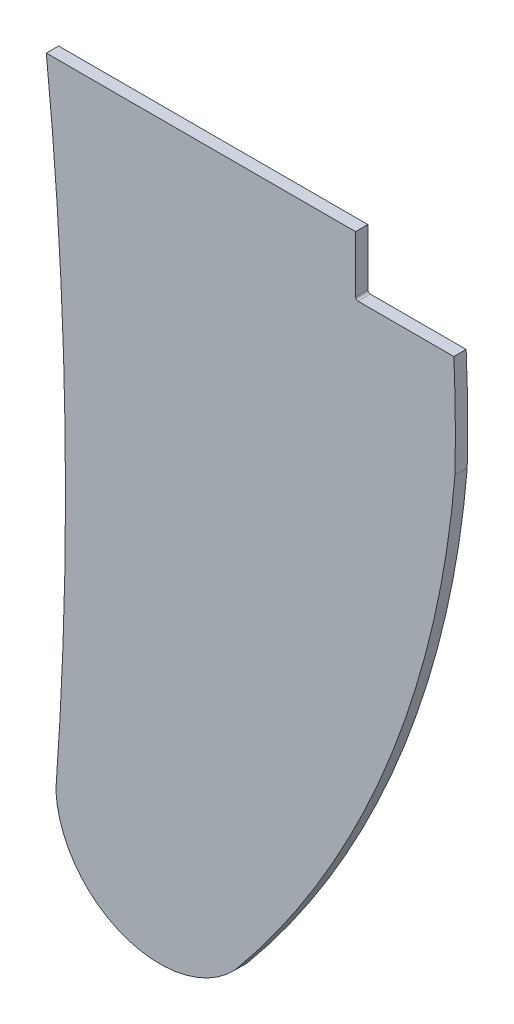
ISO-10303-21;
HEADER;
FILE_DESCRIPTION(('STEP AP214'),'2;1');
FILE_NAME('part.step','',(''),(''),'','','');
FILE_SCHEMA(('AUTOMOTIVE_DESIGN { 1 0 10303 214 1 1 1 1 }'));
ENDSEC;
DATA;
#1=APPLICATION_CONTEXT('core data for automotive mechanical design processes');
#2=APPLICATION_PROTOCOL_DEFINITION('international standard','automotive_design',2000,#1);
#3=PRODUCT_CONTEXT('',#1,'mechanical');
#4=PRODUCT('Part','Part','',(#3));
#5=PRODUCT_RELATED_PRODUCT_CATEGORY('part','',(#4));
#6=PRODUCT_DEFINITION_FORMATION('','',#4);
#7=PRODUCT_DEFINITION_CONTEXT('part definition',#1,'design');
#8=PRODUCT_DEFINITION('design','',#6,#7);
#9=PRODUCT_DEFINITION_SHAPE('','',#8);
#10=(LENGTH_UNIT() NAMED_UNIT(*) SI_UNIT(.MILLI.,.METRE.));
#11=(NAMED_UNIT(*) PLANE_ANGLE_UNIT() SI_UNIT($,.RADIAN.));
#12=(NAMED_UNIT(*) SI_UNIT($,.STERADIAN.) SOLID_ANGLE_UNIT());
#13=UNCERTAINTY_MEASURE_WITH_UNIT(LENGTH_MEASURE(1.E-05),#10,'distance_accuracy_value','');
#14=(GEOMETRIC_REPRESENTATION_CONTEXT(3) GLOBAL_UNCERTAINTY_ASSIGNED_CONTEXT((#13)) GLOBAL_UNIT_ASSIGNED_CONTEXT((#10,
#11,#12)) REPRESENTATION_CONTEXT('',''));
#15=CARTESIAN_POINT('',(0.,0.,0.));
#16=DIRECTION('',(0.,0.,1.));
#17=DIRECTION('',(1.,0.,0.));
#18=AXIS2_PLACEMENT_3D('',#15,#16,#17);
#19=CARTESIAN_POINT('',(-409.295189863832,-50.7608699241797,5.));
#20=DIRECTION('',(0.,0.,-1.));
#21=DIRECTION('',(-1.,0.,0.));
#22=AXIS2_PLACEMENT_3D('',#19,#20,#21);
#23=CYLINDRICAL_SURFACE('',#22,577.915115219369);
#24=DIRECTION('',(0.,0.,1.));
#25=VECTOR('',#24,1.);
#26=CARTESIAN_POINT('',(168.430239052864,-65.566584430278,0.));
#27=LINE('',#26,#25);
#28=CARTESIAN_POINT('',(168.430239052864,-65.566584430278,0.));
#29=VERTEX_POINT('',#28);
#30=CARTESIAN_POINT('',(168.430239052864,-65.566584430278,5.000006));
#31=VERTEX_POINT('',#30);
#32=EDGE_CURVE('E88',#29,#31,#27,.T.);
#33=ORIENTED_EDGE('',*,*,#32,.F.);
#34=CARTESIAN_POINT('',(-409.295189863832,-50.7608699241797,0.));
#35=DIRECTION('',(0.,0.,1.));
#36=DIRECTION('',(-1.,0.,0.));
#37=AXIS2_PLACEMENT_3D('',#34,#35,#36);
#38=CIRCLE('',#37,577.915115219369);
#39=CARTESIAN_POINT('',(168.,-24.,0.));
#40=VERTEX_POINT('',#39);
#41=EDGE_CURVE('E138',#29,#40,#38,.T.);
#42=ORIENTED_EDGE('',*,*,#41,.T.);
#43=DIRECTION('',(0.,0.,-1.));
#44=VECTOR('',#43,1.);
#45=CARTESIAN_POINT('',(168.,-24.,5.));
#46=LINE('',#45,#44);
#47=CARTESIAN_POINT('',(168.,-24.,5.));
#48=VERTEX_POINT('',#47);
#49=EDGE_CURVE('E111',#48,#40,#46,.T.);
#50=ORIENTED_EDGE('',*,*,#49,.F.);
#51=CARTESIAN_POINT('',(-409.295189863832,-50.7608699241797,5.));
#52=DIRECTION('',(0.,0.,1.));
#53=DIRECTION('',(-1.,0.,0.));
#54=AXIS2_PLACEMENT_3D('',#51,#52,#53);
#55=CIRCLE('',#54,577.915115219369);
#56=EDGE_CURVE('E105',#31,#48,#55,.T.);
#57=ORIENTED_EDGE('',*,*,#56,.F.);
#58=EDGE_LOOP('',(#33,#42,#50,#57));
#59=FACE_BOUND('',#58,.T.);
#60=ADVANCED_FACE('F20',(#59),#23,.T.);
#61=CARTESIAN_POINT('',(0.,0.,5.));
#62=DIRECTION('',(0.,-1.,0.));
#63=DIRECTION('',(0.,0.,-1.));
#64=AXIS2_PLACEMENT_3D('',#61,#62,#63);
#65=PLANE('',#64);
#66=DIRECTION('',(0.,0.,1.));
#67=VECTOR('',#66,1.);
#68=CARTESIAN_POINT('',(2.19203527874306,0.,0.));
#69=LINE('',#68,#67);
#70=CARTESIAN_POINT('',(2.19203527874306,0.,0.));
#71=VERTEX_POINT('',#70);
#72=CARTESIAN_POINT('',(2.19203527874306,0.,5.000006));
#73=VERTEX_POINT('',#72);
#74=EDGE_CURVE('E98',#71,#73,#69,.T.);
#75=ORIENTED_EDGE('',*,*,#74,.T.);
#76=DIRECTION('',(-1.,0.,0.));
#77=VECTOR('',#76,1.);
#78=CARTESIAN_POINT('',(0.,0.,5.));
#79=LINE('',#78,#77);
#80=CARTESIAN_POINT('',(128.,0.,5.));
#81=VERTEX_POINT('',#80);
#82=EDGE_CURVE('E24',#81,#73,#79,.T.);
#83=ORIENTED_EDGE('',*,*,#82,.F.);
#84=DIRECTION('',(0.,0.,-1.));
#85=VECTOR('',#84,1.);
#86=CARTESIAN_POINT('',(128.,0.,5.));
#87=LINE('',#86,#85);
#88=CARTESIAN_POINT('',(128.,0.,0.));
#89=VERTEX_POINT('',#88);
#90=EDGE_CURVE('E144',#81,#89,#87,.T.);
#91=ORIENTED_EDGE('',*,*,#90,.T.);
#92=DIRECTION('',(-1.,0.,0.));
#93=VECTOR('',#92,1.);
#94=CARTESIAN_POINT('',(0.,0.,0.));
#95=LINE('',#94,#93);
#96=EDGE_CURVE('E113',#89,#71,#95,.T.);
#97=ORIENTED_EDGE('',*,*,#96,.T.);
#98=EDGE_LOOP('',(#75,#83,#91,#97));
#99=FACE_BOUND('',#98,.T.);
#100=ADVANCED_FACE('F169',(#99),#65,.F.);
#101=CARTESIAN_POINT('',(-2253.88293759947,-182.06080665796,5.));
#102=DIRECTION('',(0.,0.,-1.));
#103=DIRECTION('',(-1.,0.,0.));
#104=AXIS2_PLACEMENT_3D('',#101,#102,#103);
#105=PLANE('',#104);
#106=CARTESIAN_POINT('',(-1453.55710368137,-150.840080365206,5.));
#107=DIRECTION('',(0.,0.,-1.));
#108=DIRECTION('',(-1.,0.,0.));
#109=AXIS2_PLACEMENT_3D('',#106,#107,#108);
#110=CIRCLE('',#109,1463.54305895921);
#111=CARTESIAN_POINT('',(6.0724744991285,-257.796987240415,5.));
#112=VERTEX_POINT('',#111);
#113=EDGE_CURVE('E108',#112,#73,#110,.F.);
#114=ORIENTED_EDGE('',*,*,#113,.F.);
#115=CARTESIAN_POINT('',(48.3139783499695,-255.533717212104,5.));
#116=DIRECTION('',(0.,0.,-1.));
#117=DIRECTION('',(-1.,0.,0.));
#118=AXIS2_PLACEMENT_3D('',#115,#116,#117);
#119=CIRCLE('',#118,42.3020926054689);
#120=CARTESIAN_POINT('',(79.0006139235213,-284.650678522957,5.));
#121=VERTEX_POINT('',#120);
#122=EDGE_CURVE('E107',#121,#112,#119,.T.);
#123=ORIENTED_EDGE('',*,*,#122,.F.);
#124=CARTESIAN_POINT('',(-224.377340113975,-33.0179618805903,5.));
#125=DIRECTION('',(0.,0.,-1.));
#126=DIRECTION('',(-1.,0.,0.));
#127=AXIS2_PLACEMENT_3D('',#124,#125,#126);
#128=CIRCLE('',#127,394.153786079488);
#129=EDGE_CURVE('E91',#31,#121,#128,.T.);
#130=ORIENTED_EDGE('',*,*,#129,.F.);
#131=ORIENTED_EDGE('',*,*,#56,.T.);
#132=DIRECTION('',(-1.,0.,0.));
#133=VECTOR('',#132,1.);
#134=CARTESIAN_POINT('',(128.,-24.,5.));
#135=LINE('',#134,#133);
#136=CARTESIAN_POINT('',(129.,-24.,5.));
#137=VERTEX_POINT('',#136);
#138=EDGE_CURVE('E112',#48,#137,#135,.T.);
#139=ORIENTED_EDGE('',*,*,#138,.T.);
#140=CARTESIAN_POINT('',(129.,-23.,5.));
#141=DIRECTION('',(0.,0.,-1.));
#142=DIRECTION('',(-1.,0.,0.));
#143=AXIS2_PLACEMENT_3D('',#140,#141,#142);
#144=CIRCLE('',#143,1.);
#145=CARTESIAN_POINT('',(128.,-23.,5.));
#146=VERTEX_POINT('',#145);
#147=EDGE_CURVE('E12',#137,#146,#144,.T.);
#148=ORIENTED_EDGE('',*,*,#147,.T.);
#149=DIRECTION('',(0.,1.,0.));
#150=VECTOR('',#149,1.);
#151=CARTESIAN_POINT('',(128.,0.,5.));
#152=LINE('',#151,#150);
#153=EDGE_CURVE('E114',#146,#81,#152,.T.);
#154=ORIENTED_EDGE('',*,*,#153,.T.);
#155=ORIENTED_EDGE('',*,*,#82,.T.);
#156=EDGE_LOOP('',(#114,#123,#130,#131,#139,#148,#154,#155));
#157=FACE_BOUND('',#156,.T.);
#158=ADVANCED_FACE('F104',(#157),#105,.F.);
#159=CARTESIAN_POINT('',(-2253.88293759947,-182.06080665796,0.));
#160=DIRECTION('',(0.,0.,-1.));
#161=DIRECTION('',(-1.,0.,0.));
#162=AXIS2_PLACEMENT_3D('',#159,#160,#161);
#163=PLANE('',#162);
#164=CARTESIAN_POINT('',(48.3139783499695,-255.533717212104,0.));
#165=DIRECTION('',(0.,0.,1.));
#166=DIRECTION('',(1.,0.,0.));
#167=AXIS2_PLACEMENT_3D('',#164,#165,#166);
#168=CIRCLE('',#167,42.3020926054689);
#169=CARTESIAN_POINT('',(6.07247449912585,-257.796987240485,0.));
#170=VERTEX_POINT('',#169);
#171=CARTESIAN_POINT('',(79.0006139235213,-284.650678522957,0.));
#172=VERTEX_POINT('',#171);
#173=EDGE_CURVE('E184',#170,#172,#168,.T.);
#174=ORIENTED_EDGE('',*,*,#173,.F.);
#175=CARTESIAN_POINT('',(-1453.55710368137,-150.840080365206,0.));
#176=DIRECTION('',(0.,0.,-1.));
#177=DIRECTION('',(1.,0.,0.));
#178=AXIS2_PLACEMENT_3D('',#175,#176,#177);
#179=CIRCLE('',#178,1463.54305895921);
#180=EDGE_CURVE('E37',#71,#170,#179,.T.);
#181=ORIENTED_EDGE('',*,*,#180,.F.);
#182=ORIENTED_EDGE('',*,*,#96,.F.);
#183=DIRECTION('',(0.,1.,0.));
#184=VECTOR('',#183,1.);
#185=CARTESIAN_POINT('',(128.,0.,0.));
#186=LINE('',#185,#184);
#187=CARTESIAN_POINT('',(128.,-23.,0.));
#188=VERTEX_POINT('',#187);
#189=EDGE_CURVE('E117',#188,#89,#186,.T.);
#190=ORIENTED_EDGE('',*,*,#189,.F.);
#191=CARTESIAN_POINT('',(129.,-23.,0.));
#192=DIRECTION('',(0.,0.,-1.));
#193=DIRECTION('',(-1.,0.,0.));
#194=AXIS2_PLACEMENT_3D('',#191,#192,#193);
#195=CIRCLE('',#194,1.);
#196=CARTESIAN_POINT('',(129.,-24.,0.));
#197=VERTEX_POINT('',#196);
#198=EDGE_CURVE('E29',#188,#197,#195,.F.);
#199=ORIENTED_EDGE('',*,*,#198,.T.);
#200=DIRECTION('',(-1.,0.,0.));
#201=VECTOR('',#200,1.);
#202=CARTESIAN_POINT('',(128.,-24.,0.));
#203=LINE('',#202,#201);
#204=EDGE_CURVE('E141',#40,#197,#203,.T.);
#205=ORIENTED_EDGE('',*,*,#204,.F.);
#206=ORIENTED_EDGE('',*,*,#41,.F.);
#207=CARTESIAN_POINT('',(-224.377340113975,-33.0179618805903,0.));
#208=DIRECTION('',(0.,0.,1.));
#209=DIRECTION('',(1.,0.,0.));
#210=AXIS2_PLACEMENT_3D('',#207,#208,#209);
#211=CIRCLE('',#210,394.153786079488);
#212=EDGE_CURVE('E94',#172,#29,#211,.T.);
#213=ORIENTED_EDGE('',*,*,#212,.F.);
#214=EDGE_LOOP('',(#174,#181,#182,#190,#199,#205,#206,#213));
#215=FACE_BOUND('',#214,.T.);
#216=ADVANCED_FACE('F155',(#215),#163,.T.);
#217=CARTESIAN_POINT('',(128.,-24.,5.));
#218=DIRECTION('',(0.,-1.,0.));
#219=DIRECTION('',(0.,0.,-1.));
#220=AXIS2_PLACEMENT_3D('',#217,#218,#219);
#221=PLANE('',#220);
#222=ORIENTED_EDGE('',*,*,#204,.T.);
#223=DIRECTION('',(0.,0.,-1.));
#224=VECTOR('',#223,1.);
#225=CARTESIAN_POINT('',(129.,-24.,5.));
#226=LINE('',#225,#224);
#227=EDGE_CURVE('E45',#197,#137,#226,.F.);
#228=ORIENTED_EDGE('',*,*,#227,.T.);
#229=ORIENTED_EDGE('',*,*,#138,.F.);
#230=ORIENTED_EDGE('',*,*,#49,.T.);
#231=EDGE_LOOP('',(#222,#228,#229,#230));
#232=FACE_BOUND('',#231,.T.);
#233=ADVANCED_FACE('F159',(#232),#221,.F.);
#234=CARTESIAN_POINT('',(128.,0.,5.));
#235=DIRECTION('',(-1.,0.,0.));
#236=DIRECTION('',(0.,0.,1.));
#237=AXIS2_PLACEMENT_3D('',#234,#235,#236);
#238=PLANE('',#237);
#239=ORIENTED_EDGE('',*,*,#153,.F.);
#240=DIRECTION('',(0.,0.,-1.));
#241=VECTOR('',#240,1.);
#242=CARTESIAN_POINT('',(128.,-23.,0.));
#243=LINE('',#242,#241);
#244=EDGE_CURVE('E148',#146,#188,#243,.T.);
#245=ORIENTED_EDGE('',*,*,#244,.T.);
#246=ORIENTED_EDGE('',*,*,#189,.T.);
#247=ORIENTED_EDGE('',*,*,#90,.F.);
#248=EDGE_LOOP('',(#239,#245,#246,#247));
#249=FACE_BOUND('',#248,.T.);
#250=ADVANCED_FACE('F165',(#249),#238,.F.);
#251=CARTESIAN_POINT('',(129.,-23.,5.));
#252=DIRECTION('',(0.,0.,1.));
#253=DIRECTION('',(1.,0.,0.));
#254=AXIS2_PLACEMENT_3D('',#251,#252,#253);
#255=CYLINDRICAL_SURFACE('',#254,1.);
#256=ORIENTED_EDGE('',*,*,#147,.F.);
#257=ORIENTED_EDGE('',*,*,#227,.F.);
#258=ORIENTED_EDGE('',*,*,#198,.F.);
#259=ORIENTED_EDGE('',*,*,#244,.F.);
#260=EDGE_LOOP('',(#256,#257,#258,#259));
#261=FACE_BOUND('',#260,.T.);
#262=ADVANCED_FACE('F22',(#261),#255,.F.);
#263=CARTESIAN_POINT('',(-1453.55710368137,-150.840080365206,0.));
#264=DIRECTION('',(0.,0.,1.));
#265=DIRECTION('',(1.,0.,0.));
#266=AXIS2_PLACEMENT_3D('',#263,#264,#265);
#267=CYLINDRICAL_SURFACE('',#266,1463.54305895921);
#268=ORIENTED_EDGE('',*,*,#113,.T.);
#269=ORIENTED_EDGE('',*,*,#74,.F.);
#270=ORIENTED_EDGE('',*,*,#180,.T.);
#271=DIRECTION('',(0.,0.,1.));
#272=VECTOR('',#271,1.);
#273=CARTESIAN_POINT('',(6.0724744991285,-257.796987240415,0.));
#274=LINE('',#273,#272);
#275=EDGE_CURVE('E180',#170,#112,#274,.T.);
#276=ORIENTED_EDGE('',*,*,#275,.T.);
#277=EDGE_LOOP('',(#268,#269,#270,#276));
#278=FACE_BOUND('',#277,.T.);
#279=ADVANCED_FACE('F189',(#278),#267,.F.);
#280=CARTESIAN_POINT('',(-224.377340113975,-33.0179618805903,0.));
#281=DIRECTION('',(0.,0.,1.));
#282=DIRECTION('',(1.,0.,0.));
#283=AXIS2_PLACEMENT_3D('',#280,#281,#282);
#284=CYLINDRICAL_SURFACE('',#283,394.153786079488);
#285=ORIENTED_EDGE('',*,*,#129,.T.);
#286=DIRECTION('',(0.,0.,1.));
#287=VECTOR('',#286,1.);
#288=CARTESIAN_POINT('',(79.0006139235213,-284.650678522957,0.));
#289=LINE('',#288,#287);
#290=EDGE_CURVE('E99',#172,#121,#289,.T.);
#291=ORIENTED_EDGE('',*,*,#290,.F.);
#292=ORIENTED_EDGE('',*,*,#212,.T.);
#293=ORIENTED_EDGE('',*,*,#32,.T.);
#294=EDGE_LOOP('',(#285,#291,#292,#293));
#295=FACE_BOUND('',#294,.T.);
#296=ADVANCED_FACE('F90',(#295),#284,.T.);
#297=CARTESIAN_POINT('',(48.3139783499695,-255.533717212104,0.));
#298=DIRECTION('',(0.,0.,1.));
#299=DIRECTION('',(1.,0.,0.));
#300=AXIS2_PLACEMENT_3D('',#297,#298,#299);
#301=CYLINDRICAL_SURFACE('',#300,42.3020926054689);
#302=ORIENTED_EDGE('',*,*,#122,.T.);
#303=ORIENTED_EDGE('',*,*,#275,.F.);
#304=ORIENTED_EDGE('',*,*,#173,.T.);
#305=ORIENTED_EDGE('',*,*,#290,.T.);
#306=EDGE_LOOP('',(#302,#303,#304,#305));
#307=FACE_BOUND('',#306,.T.);
#308=ADVANCED_FACE('F188',(#307),#301,.T.);
#309=CLOSED_SHELL('',(#60,#100,#158,#216,#233,#250,#262,#279,#296,#308));
#310=MANIFOLD_SOLID_BREP('B1',#309);
#311=ADVANCED_BREP_SHAPE_REPRESENTATION('',(#18,#310),#14);
#312=SHAPE_DEFINITION_REPRESENTATION(#9,#311);
ENDSEC;
END-ISO-10303-21;
